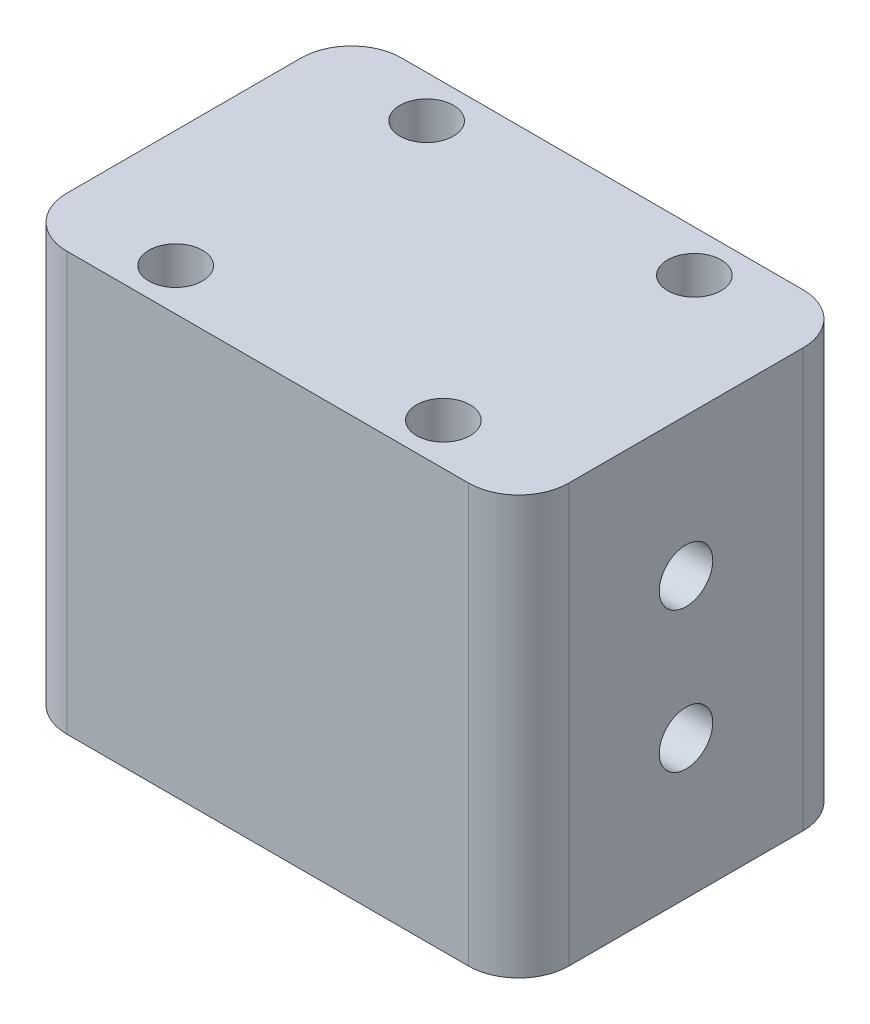
ISO-10303-21;
HEADER;
FILE_DESCRIPTION(('STEP AP214'),'2;1');
FILE_NAME('part.step','',(''),(''),'','','');
FILE_SCHEMA(('AUTOMOTIVE_DESIGN { 1 0 10303 214 1 1 1 1 }'));
ENDSEC;
DATA;
#1=APPLICATION_CONTEXT('core data for automotive mechanical design processes');
#2=APPLICATION_PROTOCOL_DEFINITION('international standard','automotive_design',2000,#1);
#3=PRODUCT_CONTEXT('',#1,'mechanical');
#4=PRODUCT('Part','Part','',(#3));
#5=PRODUCT_RELATED_PRODUCT_CATEGORY('part','',(#4));
#6=PRODUCT_DEFINITION_FORMATION('','',#4);
#7=PRODUCT_DEFINITION_CONTEXT('part definition',#1,'design');
#8=PRODUCT_DEFINITION('design','',#6,#7);
#9=PRODUCT_DEFINITION_SHAPE('','',#8);
#10=(LENGTH_UNIT() NAMED_UNIT(*) SI_UNIT(.MILLI.,.METRE.));
#11=(NAMED_UNIT(*) PLANE_ANGLE_UNIT() SI_UNIT($,.RADIAN.));
#12=(NAMED_UNIT(*) SI_UNIT($,.STERADIAN.) SOLID_ANGLE_UNIT());
#13=UNCERTAINTY_MEASURE_WITH_UNIT(LENGTH_MEASURE(1.E-05),#10,'distance_accuracy_value','');
#14=(GEOMETRIC_REPRESENTATION_CONTEXT(3) GLOBAL_UNCERTAINTY_ASSIGNED_CONTEXT((#13)) GLOBAL_UNIT_ASSIGNED_CONTEXT((#10,
#11,#12)) REPRESENTATION_CONTEXT('',''));
#15=CARTESIAN_POINT('',(0.,0.,0.));
#16=DIRECTION('',(0.,0.,1.));
#17=DIRECTION('',(1.,0.,0.));
#18=AXIS2_PLACEMENT_3D('',#15,#16,#17);
#19=CARTESIAN_POINT('',(0.,25.,0.));
#20=DIRECTION('',(0.,1.,0.));
#21=DIRECTION('',(0.,0.,1.));
#22=AXIS2_PLACEMENT_3D('',#19,#20,#21);
#23=PLANE('',#22);
#24=CARTESIAN_POINT('',(8.,25.,7.5));
#25=DIRECTION('',(0.,1.,0.));
#26=DIRECTION('',(0.,0.,1.));
#27=AXIS2_PLACEMENT_3D('',#24,#25,#26);
#28=CIRCLE('',#27,1.6);
#29=CARTESIAN_POINT('',(8.,25.,9.1));
#30=VERTEX_POINT('',#29);
#31=EDGE_CURVE('E188',#30,#30,#28,.T.);
#32=ORIENTED_EDGE('',*,*,#31,.F.);
#33=EDGE_LOOP('',(#32));
#34=FACE_BOUND('',#33,.T.);
#35=CARTESIAN_POINT('',(-8.00000000000001,25.,-7.5));
#36=DIRECTION('',(0.,1.,0.));
#37=DIRECTION('',(0.,0.,1.));
#38=AXIS2_PLACEMENT_3D('',#35,#36,#37);
#39=CIRCLE('',#38,1.6);
#40=CARTESIAN_POINT('',(-8.00000000000001,25.,-5.9));
#41=VERTEX_POINT('',#40);
#42=EDGE_CURVE('E134',#41,#41,#39,.T.);
#43=ORIENTED_EDGE('',*,*,#42,.F.);
#44=EDGE_LOOP('',(#43));
#45=FACE_BOUND('',#44,.T.);
#46=DIRECTION('',(0.,0.,-1.));
#47=VECTOR('',#46,1.);
#48=CARTESIAN_POINT('',(15.,25.,-10.));
#49=LINE('',#48,#47);
#50=CARTESIAN_POINT('',(15.,25.,7.));
#51=VERTEX_POINT('',#50);
#52=CARTESIAN_POINT('',(15.,25.,-7.));
#53=VERTEX_POINT('',#52);
#54=EDGE_CURVE('E139',#51,#53,#49,.T.);
#55=ORIENTED_EDGE('',*,*,#54,.T.);
#56=CARTESIAN_POINT('',(12.,25.,-7.));
#57=DIRECTION('',(0.,1.,0.));
#58=DIRECTION('',(0.,0.,1.));
#59=AXIS2_PLACEMENT_3D('',#56,#57,#58);
#60=CIRCLE('',#59,3.);
#61=CARTESIAN_POINT('',(12.,25.,-10.));
#62=VERTEX_POINT('',#61);
#63=EDGE_CURVE('E154',#53,#62,#60,.T.);
#64=ORIENTED_EDGE('',*,*,#63,.T.);
#65=DIRECTION('',(-1.,0.,0.));
#66=VECTOR('',#65,1.);
#67=CARTESIAN_POINT('',(-15.,25.,-10.));
#68=LINE('',#67,#66);
#69=CARTESIAN_POINT('',(-12.,25.,-10.));
#70=VERTEX_POINT('',#69);
#71=EDGE_CURVE('E121',#62,#70,#68,.T.);
#72=ORIENTED_EDGE('',*,*,#71,.T.);
#73=CARTESIAN_POINT('',(-12.,25.,-7.));
#74=DIRECTION('',(0.,1.,0.));
#75=DIRECTION('',(0.,0.,1.));
#76=AXIS2_PLACEMENT_3D('',#73,#74,#75);
#77=CIRCLE('',#76,3.);
#78=CARTESIAN_POINT('',(-15.,25.,-7.));
#79=VERTEX_POINT('',#78);
#80=EDGE_CURVE('E152',#70,#79,#77,.T.);
#81=ORIENTED_EDGE('',*,*,#80,.T.);
#82=DIRECTION('',(0.,0.,1.));
#83=VECTOR('',#82,1.);
#84=CARTESIAN_POINT('',(-15.,25.,-10.));
#85=LINE('',#84,#83);
#86=CARTESIAN_POINT('',(-15.,25.,7.));
#87=VERTEX_POINT('',#86);
#88=EDGE_CURVE('E165',#79,#87,#85,.T.);
#89=ORIENTED_EDGE('',*,*,#88,.T.);
#90=CARTESIAN_POINT('',(-12.,25.,7.));
#91=DIRECTION('',(0.,1.,0.));
#92=DIRECTION('',(0.,0.,1.));
#93=AXIS2_PLACEMENT_3D('',#90,#91,#92);
#94=CIRCLE('',#93,3.);
#95=CARTESIAN_POINT('',(-12.,25.,10.));
#96=VERTEX_POINT('',#95);
#97=EDGE_CURVE('E56',#87,#96,#94,.T.);
#98=ORIENTED_EDGE('',*,*,#97,.T.);
#99=DIRECTION('',(1.,0.,0.));
#100=VECTOR('',#99,1.);
#101=CARTESIAN_POINT('',(-15.,25.,10.));
#102=LINE('',#101,#100);
#103=CARTESIAN_POINT('',(12.,25.,10.));
#104=VERTEX_POINT('',#103);
#105=EDGE_CURVE('E140',#96,#104,#102,.T.);
#106=ORIENTED_EDGE('',*,*,#105,.T.);
#107=CARTESIAN_POINT('',(12.,25.,7.));
#108=DIRECTION('',(0.,1.,0.));
#109=DIRECTION('',(0.,0.,1.));
#110=AXIS2_PLACEMENT_3D('',#107,#108,#109);
#111=CIRCLE('',#110,3.);
#112=EDGE_CURVE('E149',#104,#51,#111,.T.);
#113=ORIENTED_EDGE('',*,*,#112,.T.);
#114=EDGE_LOOP('',(#55,#64,#72,#81,#89,#98,#106,#113));
#115=FACE_BOUND('',#114,.T.);
#116=CARTESIAN_POINT('',(-8.,25.,7.5));
#117=DIRECTION('',(0.,1.,0.));
#118=DIRECTION('',(0.,0.,1.));
#119=AXIS2_PLACEMENT_3D('',#116,#117,#118);
#120=CIRCLE('',#119,1.6);
#121=CARTESIAN_POINT('',(-8.,25.,9.1));
#122=VERTEX_POINT('',#121);
#123=EDGE_CURVE('E182',#122,#122,#120,.T.);
#124=ORIENTED_EDGE('',*,*,#123,.F.);
#125=EDGE_LOOP('',(#124));
#126=FACE_BOUND('',#125,.T.);
#127=CARTESIAN_POINT('',(7.99999999999999,25.,-7.5));
#128=DIRECTION('',(0.,1.,0.));
#129=DIRECTION('',(0.,0.,1.));
#130=AXIS2_PLACEMENT_3D('',#127,#128,#129);
#131=CIRCLE('',#130,1.6);
#132=CARTESIAN_POINT('',(7.99999999999999,25.,-5.9));
#133=VERTEX_POINT('',#132);
#134=EDGE_CURVE('E194',#133,#133,#131,.T.);
#135=ORIENTED_EDGE('',*,*,#134,.F.);
#136=EDGE_LOOP('',(#135));
#137=FACE_BOUND('',#136,.T.);
#138=ADVANCED_FACE('F35',(#34,#45,#115,#126,#137),#23,.T.);
#139=CARTESIAN_POINT('',(0.,0.,0.));
#140=DIRECTION('',(0.,1.,0.));
#141=DIRECTION('',(0.,0.,1.));
#142=AXIS2_PLACEMENT_3D('',#139,#140,#141);
#143=PLANE('',#142);
#144=DIRECTION('',(-1.,0.,0.));
#145=VECTOR('',#144,1.);
#146=CARTESIAN_POINT('',(-15.,0.,-10.));
#147=LINE('',#146,#145);
#148=CARTESIAN_POINT('',(12.,0.,-10.));
#149=VERTEX_POINT('',#148);
#150=CARTESIAN_POINT('',(-12.,0.,-10.));
#151=VERTEX_POINT('',#150);
#152=EDGE_CURVE('E118',#149,#151,#147,.T.);
#153=ORIENTED_EDGE('',*,*,#152,.F.);
#154=CARTESIAN_POINT('',(12.,0.,-7.));
#155=DIRECTION('',(0.,1.,0.));
#156=DIRECTION('',(0.,0.,1.));
#157=AXIS2_PLACEMENT_3D('',#154,#155,#156);
#158=CIRCLE('',#157,3.);
#159=CARTESIAN_POINT('',(15.,0.,-7.));
#160=VERTEX_POINT('',#159);
#161=EDGE_CURVE('E101',#149,#160,#158,.F.);
#162=ORIENTED_EDGE('',*,*,#161,.T.);
#163=DIRECTION('',(0.,0.,-1.));
#164=VECTOR('',#163,1.);
#165=CARTESIAN_POINT('',(15.,0.,-10.));
#166=LINE('',#165,#164);
#167=CARTESIAN_POINT('',(15.,0.,7.));
#168=VERTEX_POINT('',#167);
#169=EDGE_CURVE('E129',#168,#160,#166,.T.);
#170=ORIENTED_EDGE('',*,*,#169,.F.);
#171=CARTESIAN_POINT('',(12.,0.,7.));
#172=DIRECTION('',(0.,1.,0.));
#173=DIRECTION('',(0.,0.,1.));
#174=AXIS2_PLACEMENT_3D('',#171,#172,#173);
#175=CIRCLE('',#174,3.);
#176=CARTESIAN_POINT('',(12.,0.,10.));
#177=VERTEX_POINT('',#176);
#178=EDGE_CURVE('E122',#168,#177,#175,.F.);
#179=ORIENTED_EDGE('',*,*,#178,.T.);
#180=DIRECTION('',(1.,0.,0.));
#181=VECTOR('',#180,1.);
#182=CARTESIAN_POINT('',(-15.,0.,10.));
#183=LINE('',#182,#181);
#184=CARTESIAN_POINT('',(-12.,0.,10.));
#185=VERTEX_POINT('',#184);
#186=EDGE_CURVE('E132',#185,#177,#183,.T.);
#187=ORIENTED_EDGE('',*,*,#186,.F.);
#188=CARTESIAN_POINT('',(-12.,0.,7.));
#189=DIRECTION('',(0.,1.,0.));
#190=DIRECTION('',(0.,0.,1.));
#191=AXIS2_PLACEMENT_3D('',#188,#189,#190);
#192=CIRCLE('',#191,3.);
#193=CARTESIAN_POINT('',(-15.,0.,7.));
#194=VERTEX_POINT('',#193);
#195=EDGE_CURVE('E143',#185,#194,#192,.F.);
#196=ORIENTED_EDGE('',*,*,#195,.T.);
#197=DIRECTION('',(0.,0.,1.));
#198=VECTOR('',#197,1.);
#199=CARTESIAN_POINT('',(-15.,0.,-10.));
#200=LINE('',#199,#198);
#201=CARTESIAN_POINT('',(-15.,0.,-7.));
#202=VERTEX_POINT('',#201);
#203=EDGE_CURVE('E128',#202,#194,#200,.T.);
#204=ORIENTED_EDGE('',*,*,#203,.F.);
#205=CARTESIAN_POINT('',(-12.,0.,-7.));
#206=DIRECTION('',(0.,1.,0.));
#207=DIRECTION('',(0.,0.,1.));
#208=AXIS2_PLACEMENT_3D('',#205,#206,#207);
#209=CIRCLE('',#208,3.);
#210=EDGE_CURVE('E112',#202,#151,#209,.F.);
#211=ORIENTED_EDGE('',*,*,#210,.T.);
#212=EDGE_LOOP('',(#153,#162,#170,#179,#187,#196,#204,#211));
#213=FACE_BOUND('',#212,.T.);
#214=CARTESIAN_POINT('',(-8.00000000000001,0.,-7.5));
#215=DIRECTION('',(0.,1.,0.));
#216=DIRECTION('',(0.,0.,1.));
#217=AXIS2_PLACEMENT_3D('',#214,#215,#216);
#218=CIRCLE('',#217,1.6);
#219=CARTESIAN_POINT('',(-8.00000000000001,0.,-5.9));
#220=VERTEX_POINT('',#219);
#221=EDGE_CURVE('E179',#220,#220,#218,.T.);
#222=ORIENTED_EDGE('',*,*,#221,.T.);
#223=EDGE_LOOP('',(#222));
#224=FACE_BOUND('',#223,.T.);
#225=CARTESIAN_POINT('',(-8.,0.,7.5));
#226=DIRECTION('',(0.,1.,0.));
#227=DIRECTION('',(0.,0.,1.));
#228=AXIS2_PLACEMENT_3D('',#225,#226,#227);
#229=CIRCLE('',#228,1.6);
#230=CARTESIAN_POINT('',(-8.,0.,9.1));
#231=VERTEX_POINT('',#230);
#232=EDGE_CURVE('E185',#231,#231,#229,.T.);
#233=ORIENTED_EDGE('',*,*,#232,.T.);
#234=EDGE_LOOP('',(#233));
#235=FACE_BOUND('',#234,.T.);
#236=CARTESIAN_POINT('',(8.,0.,7.5));
#237=DIRECTION('',(0.,1.,0.));
#238=DIRECTION('',(0.,0.,1.));
#239=AXIS2_PLACEMENT_3D('',#236,#237,#238);
#240=CIRCLE('',#239,1.6);
#241=CARTESIAN_POINT('',(8.,0.,9.1));
#242=VERTEX_POINT('',#241);
#243=EDGE_CURVE('E191',#242,#242,#240,.T.);
#244=ORIENTED_EDGE('',*,*,#243,.T.);
#245=EDGE_LOOP('',(#244));
#246=FACE_BOUND('',#245,.T.);
#247=CARTESIAN_POINT('',(7.99999999999999,0.,-7.5));
#248=DIRECTION('',(0.,1.,0.));
#249=DIRECTION('',(0.,0.,1.));
#250=AXIS2_PLACEMENT_3D('',#247,#248,#249);
#251=CIRCLE('',#250,1.6);
#252=CARTESIAN_POINT('',(7.99999999999999,0.,-5.9));
#253=VERTEX_POINT('',#252);
#254=EDGE_CURVE('E197',#253,#253,#251,.T.);
#255=ORIENTED_EDGE('',*,*,#254,.T.);
#256=EDGE_LOOP('',(#255));
#257=FACE_BOUND('',#256,.T.);
#258=ADVANCED_FACE('F125',(#213,#224,#235,#246,#257),#143,.F.);
#259=CARTESIAN_POINT('',(15.,25.,-10.));
#260=DIRECTION('',(-1.,0.,0.));
#261=DIRECTION('',(0.,0.,1.));
#262=AXIS2_PLACEMENT_3D('',#259,#260,#261);
#263=PLANE('',#262);
#264=CARTESIAN_POINT('',(15.,16.7,0.));
#265=DIRECTION('',(1.,0.,0.));
#266=DIRECTION('',(0.,0.,-1.));
#267=AXIS2_PLACEMENT_3D('',#264,#265,#266);
#268=CIRCLE('',#267,1.6);
#269=CARTESIAN_POINT('',(15.,16.7,-1.6));
#270=VERTEX_POINT('',#269);
#271=EDGE_CURVE('E209',#270,#270,#268,.T.);
#272=ORIENTED_EDGE('',*,*,#271,.F.);
#273=EDGE_LOOP('',(#272));
#274=FACE_BOUND('',#273,.T.);
#275=CARTESIAN_POINT('',(15.,8.3,0.));
#276=DIRECTION('',(1.,0.,0.));
#277=DIRECTION('',(0.,0.,-1.));
#278=AXIS2_PLACEMENT_3D('',#275,#276,#277);
#279=CIRCLE('',#278,1.6);
#280=CARTESIAN_POINT('',(15.,8.3,-1.6));
#281=VERTEX_POINT('',#280);
#282=EDGE_CURVE('E203',#281,#281,#279,.T.);
#283=ORIENTED_EDGE('',*,*,#282,.F.);
#284=EDGE_LOOP('',(#283));
#285=FACE_BOUND('',#284,.T.);
#286=ORIENTED_EDGE('',*,*,#169,.T.);
#287=DIRECTION('',(0.,-1.,0.));
#288=VECTOR('',#287,1.);
#289=CARTESIAN_POINT('',(15.,25.,-7.));
#290=LINE('',#289,#288);
#291=EDGE_CURVE('E106',#160,#53,#290,.F.);
#292=ORIENTED_EDGE('',*,*,#291,.T.);
#293=ORIENTED_EDGE('',*,*,#54,.F.);
#294=DIRECTION('',(0.,-1.,0.));
#295=VECTOR('',#294,1.);
#296=CARTESIAN_POINT('',(15.,25.,7.));
#297=LINE('',#296,#295);
#298=EDGE_CURVE('E111',#51,#168,#297,.T.);
#299=ORIENTED_EDGE('',*,*,#298,.T.);
#300=EDGE_LOOP('',(#286,#292,#293,#299));
#301=FACE_BOUND('',#300,.T.);
#302=ADVANCED_FACE('F224',(#274,#285,#301),#263,.F.);
#303=CARTESIAN_POINT('',(-15.,25.,-10.));
#304=DIRECTION('',(0.,0.,1.));
#305=DIRECTION('',(1.,0.,0.));
#306=AXIS2_PLACEMENT_3D('',#303,#304,#305);
#307=PLANE('',#306);
#308=ORIENTED_EDGE('',*,*,#71,.F.);
#309=DIRECTION('',(0.,-1.,0.));
#310=VECTOR('',#309,1.);
#311=CARTESIAN_POINT('',(12.,25.,-10.));
#312=LINE('',#311,#310);
#313=EDGE_CURVE('E105',#62,#149,#312,.T.);
#314=ORIENTED_EDGE('',*,*,#313,.T.);
#315=ORIENTED_EDGE('',*,*,#152,.T.);
#316=DIRECTION('',(0.,-1.,0.));
#317=VECTOR('',#316,1.);
#318=CARTESIAN_POINT('',(-12.,25.,-10.));
#319=LINE('',#318,#317);
#320=EDGE_CURVE('E123',#151,#70,#319,.F.);
#321=ORIENTED_EDGE('',*,*,#320,.T.);
#322=EDGE_LOOP('',(#308,#314,#315,#321));
#323=FACE_BOUND('',#322,.T.);
#324=ADVANCED_FACE('F117',(#323),#307,.F.);
#325=CARTESIAN_POINT('',(-15.,25.,-10.));
#326=DIRECTION('',(1.,0.,0.));
#327=DIRECTION('',(0.,0.,-1.));
#328=AXIS2_PLACEMENT_3D('',#325,#326,#327);
#329=PLANE('',#328);
#330=CARTESIAN_POINT('',(-15.,16.7,0.));
#331=DIRECTION('',(1.,0.,0.));
#332=DIRECTION('',(0.,0.,-1.));
#333=AXIS2_PLACEMENT_3D('',#330,#331,#332);
#334=CIRCLE('',#333,1.6);
#335=CARTESIAN_POINT('',(-15.,16.7,-1.6));
#336=VERTEX_POINT('',#335);
#337=EDGE_CURVE('E206',#336,#336,#334,.T.);
#338=ORIENTED_EDGE('',*,*,#337,.T.);
#339=EDGE_LOOP('',(#338));
#340=FACE_BOUND('',#339,.T.);
#341=CARTESIAN_POINT('',(-15.,8.3,0.));
#342=DIRECTION('',(1.,0.,0.));
#343=DIRECTION('',(0.,0.,-1.));
#344=AXIS2_PLACEMENT_3D('',#341,#342,#343);
#345=CIRCLE('',#344,1.6);
#346=CARTESIAN_POINT('',(-15.,8.3,-1.6));
#347=VERTEX_POINT('',#346);
#348=EDGE_CURVE('E200',#347,#347,#345,.T.);
#349=ORIENTED_EDGE('',*,*,#348,.T.);
#350=EDGE_LOOP('',(#349));
#351=FACE_BOUND('',#350,.T.);
#352=ORIENTED_EDGE('',*,*,#88,.F.);
#353=DIRECTION('',(0.,-1.,0.));
#354=VECTOR('',#353,1.);
#355=CARTESIAN_POINT('',(-15.,25.,-7.));
#356=LINE('',#355,#354);
#357=EDGE_CURVE('E158',#79,#202,#356,.T.);
#358=ORIENTED_EDGE('',*,*,#357,.T.);
#359=ORIENTED_EDGE('',*,*,#203,.T.);
#360=DIRECTION('',(0.,-1.,0.));
#361=VECTOR('',#360,1.);
#362=CARTESIAN_POINT('',(-15.,25.,7.));
#363=LINE('',#362,#361);
#364=EDGE_CURVE('E156',#194,#87,#363,.F.);
#365=ORIENTED_EDGE('',*,*,#364,.T.);
#366=EDGE_LOOP('',(#352,#358,#359,#365));
#367=FACE_BOUND('',#366,.T.);
#368=ADVANCED_FACE('F163',(#340,#351,#367),#329,.F.);
#369=CARTESIAN_POINT('',(-15.,25.,10.));
#370=DIRECTION('',(0.,0.,-1.));
#371=DIRECTION('',(-1.,0.,0.));
#372=AXIS2_PLACEMENT_3D('',#369,#370,#371);
#373=PLANE('',#372);
#374=ORIENTED_EDGE('',*,*,#105,.F.);
#375=DIRECTION('',(0.,-1.,0.));
#376=VECTOR('',#375,1.);
#377=CARTESIAN_POINT('',(-12.,25.,10.));
#378=LINE('',#377,#376);
#379=EDGE_CURVE('E11',#96,#185,#378,.T.);
#380=ORIENTED_EDGE('',*,*,#379,.T.);
#381=ORIENTED_EDGE('',*,*,#186,.T.);
#382=DIRECTION('',(0.,-1.,0.));
#383=VECTOR('',#382,1.);
#384=CARTESIAN_POINT('',(12.,25.,10.));
#385=LINE('',#384,#383);
#386=EDGE_CURVE('E43',#177,#104,#385,.F.);
#387=ORIENTED_EDGE('',*,*,#386,.T.);
#388=EDGE_LOOP('',(#374,#380,#381,#387));
#389=FACE_BOUND('',#388,.T.);
#390=ADVANCED_FACE('F172',(#389),#373,.F.);
#391=CARTESIAN_POINT('',(-8.00000000000001,25.,-7.5));
#392=DIRECTION('',(0.,-1.,0.));
#393=DIRECTION('',(0.,0.,-1.));
#394=AXIS2_PLACEMENT_3D('',#391,#392,#393);
#395=CYLINDRICAL_SURFACE('',#394,1.6);
#396=ORIENTED_EDGE('',*,*,#42,.T.);
#397=EDGE_LOOP('',(#396));
#398=FACE_BOUND('',#397,.T.);
#399=ORIENTED_EDGE('',*,*,#221,.F.);
#400=EDGE_LOOP('',(#399));
#401=FACE_BOUND('',#400,.T.);
#402=ADVANCED_FACE('F253',(#398,#401),#395,.F.);
#403=CARTESIAN_POINT('',(-8.,25.,7.5));
#404=DIRECTION('',(0.,-1.,0.));
#405=DIRECTION('',(0.,0.,-1.));
#406=AXIS2_PLACEMENT_3D('',#403,#404,#405);
#407=CYLINDRICAL_SURFACE('',#406,1.6);
#408=ORIENTED_EDGE('',*,*,#123,.T.);
#409=EDGE_LOOP('',(#408));
#410=FACE_BOUND('',#409,.T.);
#411=ORIENTED_EDGE('',*,*,#232,.F.);
#412=EDGE_LOOP('',(#411));
#413=FACE_BOUND('',#412,.T.);
#414=ADVANCED_FACE('F276',(#410,#413),#407,.F.);
#415=CARTESIAN_POINT('',(8.,25.,7.5));
#416=DIRECTION('',(0.,-1.,0.));
#417=DIRECTION('',(0.,0.,-1.));
#418=AXIS2_PLACEMENT_3D('',#415,#416,#417);
#419=CYLINDRICAL_SURFACE('',#418,1.6);
#420=ORIENTED_EDGE('',*,*,#31,.T.);
#421=EDGE_LOOP('',(#420));
#422=FACE_BOUND('',#421,.T.);
#423=ORIENTED_EDGE('',*,*,#243,.F.);
#424=EDGE_LOOP('',(#423));
#425=FACE_BOUND('',#424,.T.);
#426=ADVANCED_FACE('F283',(#422,#425),#419,.F.);
#427=CARTESIAN_POINT('',(7.99999999999999,25.,-7.5));
#428=DIRECTION('',(0.,-1.,0.));
#429=DIRECTION('',(0.,0.,-1.));
#430=AXIS2_PLACEMENT_3D('',#427,#428,#429);
#431=CYLINDRICAL_SURFACE('',#430,1.6);
#432=ORIENTED_EDGE('',*,*,#134,.T.);
#433=EDGE_LOOP('',(#432));
#434=FACE_BOUND('',#433,.T.);
#435=ORIENTED_EDGE('',*,*,#254,.F.);
#436=EDGE_LOOP('',(#435));
#437=FACE_BOUND('',#436,.T.);
#438=ADVANCED_FACE('F241',(#434,#437),#431,.F.);
#439=CARTESIAN_POINT('',(12.,25.,-7.));
#440=DIRECTION('',(0.,-1.,0.));
#441=DIRECTION('',(0.,0.,-1.));
#442=AXIS2_PLACEMENT_3D('',#439,#440,#441);
#443=CYLINDRICAL_SURFACE('',#442,3.);
#444=ORIENTED_EDGE('',*,*,#63,.F.);
#445=ORIENTED_EDGE('',*,*,#291,.F.);
#446=ORIENTED_EDGE('',*,*,#161,.F.);
#447=ORIENTED_EDGE('',*,*,#313,.F.);
#448=EDGE_LOOP('',(#444,#445,#446,#447));
#449=FACE_BOUND('',#448,.T.);
#450=ADVANCED_FACE('F104',(#449),#443,.T.);
#451=CARTESIAN_POINT('',(-12.,25.,-7.));
#452=DIRECTION('',(0.,-1.,0.));
#453=DIRECTION('',(0.,0.,-1.));
#454=AXIS2_PLACEMENT_3D('',#451,#452,#453);
#455=CYLINDRICAL_SURFACE('',#454,3.);
#456=ORIENTED_EDGE('',*,*,#80,.F.);
#457=ORIENTED_EDGE('',*,*,#320,.F.);
#458=ORIENTED_EDGE('',*,*,#210,.F.);
#459=ORIENTED_EDGE('',*,*,#357,.F.);
#460=EDGE_LOOP('',(#456,#457,#458,#459));
#461=FACE_BOUND('',#460,.T.);
#462=ADVANCED_FACE('F234',(#461),#455,.T.);
#463=CARTESIAN_POINT('',(-12.,25.,7.));
#464=DIRECTION('',(0.,-1.,0.));
#465=DIRECTION('',(0.,0.,-1.));
#466=AXIS2_PLACEMENT_3D('',#463,#464,#465);
#467=CYLINDRICAL_SURFACE('',#466,3.);
#468=ORIENTED_EDGE('',*,*,#97,.F.);
#469=ORIENTED_EDGE('',*,*,#364,.F.);
#470=ORIENTED_EDGE('',*,*,#195,.F.);
#471=ORIENTED_EDGE('',*,*,#379,.F.);
#472=EDGE_LOOP('',(#468,#469,#470,#471));
#473=FACE_BOUND('',#472,.T.);
#474=ADVANCED_FACE('F171',(#473),#467,.T.);
#475=CARTESIAN_POINT('',(12.,25.,7.));
#476=DIRECTION('',(0.,-1.,0.));
#477=DIRECTION('',(0.,0.,-1.));
#478=AXIS2_PLACEMENT_3D('',#475,#476,#477);
#479=CYLINDRICAL_SURFACE('',#478,3.);
#480=ORIENTED_EDGE('',*,*,#112,.F.);
#481=ORIENTED_EDGE('',*,*,#386,.F.);
#482=ORIENTED_EDGE('',*,*,#178,.F.);
#483=ORIENTED_EDGE('',*,*,#298,.F.);
#484=EDGE_LOOP('',(#480,#481,#482,#483));
#485=FACE_BOUND('',#484,.T.);
#486=ADVANCED_FACE('F37',(#485),#479,.T.);
#487=CARTESIAN_POINT('',(-15.,8.3,0.));
#488=DIRECTION('',(1.,0.,0.));
#489=DIRECTION('',(0.,0.,-1.));
#490=AXIS2_PLACEMENT_3D('',#487,#488,#489);
#491=CYLINDRICAL_SURFACE('',#490,1.6);
#492=ORIENTED_EDGE('',*,*,#348,.F.);
#493=EDGE_LOOP('',(#492));
#494=FACE_BOUND('',#493,.T.);
#495=ORIENTED_EDGE('',*,*,#282,.T.);
#496=EDGE_LOOP('',(#495));
#497=FACE_BOUND('',#496,.T.);
#498=ADVANCED_FACE('F220',(#494,#497),#491,.F.);
#499=CARTESIAN_POINT('',(-15.,16.7,0.));
#500=DIRECTION('',(1.,0.,0.));
#501=DIRECTION('',(0.,0.,-1.));
#502=AXIS2_PLACEMENT_3D('',#499,#500,#501);
#503=CYLINDRICAL_SURFACE('',#502,1.6);
#504=ORIENTED_EDGE('',*,*,#337,.F.);
#505=EDGE_LOOP('',(#504));
#506=FACE_BOUND('',#505,.T.);
#507=ORIENTED_EDGE('',*,*,#271,.T.);
#508=EDGE_LOOP('',(#507));
#509=FACE_BOUND('',#508,.T.);
#510=ADVANCED_FACE('F217',(#506,#509),#503,.F.);
#511=CLOSED_SHELL('',(#138,#258,#302,#324,#368,#390,#402,#414,#426,#438,#450,#462,#474,#486,
#498,#510));
#512=MANIFOLD_SOLID_BREP('B2',#511);
#513=ADVANCED_BREP_SHAPE_REPRESENTATION('',(#18,#512),#14);
#514=SHAPE_DEFINITION_REPRESENTATION(#9,#513);
ENDSEC;
END-ISO-10303-21;
